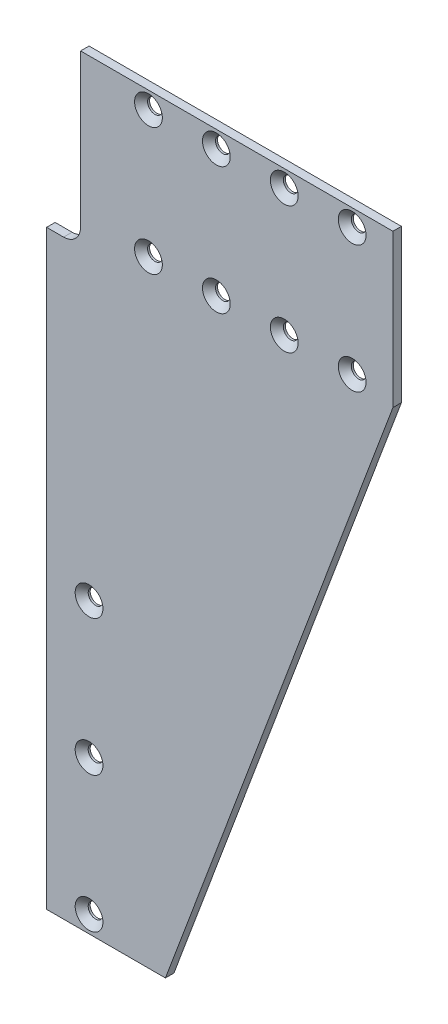
ISO-10303-21;
HEADER;
FILE_DESCRIPTION(('STEP AP214'),'2;1');
FILE_NAME('part.step','',(''),(''),'','','');
FILE_SCHEMA(('AUTOMOTIVE_DESIGN { 1 0 10303 214 1 1 1 1 }'));
ENDSEC;
DATA;
#1=APPLICATION_CONTEXT('core data for automotive mechanical design processes');
#2=APPLICATION_PROTOCOL_DEFINITION('international standard','automotive_design',2000,#1);
#3=PRODUCT_CONTEXT('',#1,'mechanical');
#4=PRODUCT('Part','Part','',(#3));
#5=PRODUCT_RELATED_PRODUCT_CATEGORY('part','',(#4));
#6=PRODUCT_DEFINITION_FORMATION('','',#4);
#7=PRODUCT_DEFINITION_CONTEXT('part definition',#1,'design');
#8=PRODUCT_DEFINITION('design','',#6,#7);
#9=PRODUCT_DEFINITION_SHAPE('','',#8);
#10=(LENGTH_UNIT() NAMED_UNIT(*) SI_UNIT(.MILLI.,.METRE.));
#11=(NAMED_UNIT(*) PLANE_ANGLE_UNIT() SI_UNIT($,.RADIAN.));
#12=(NAMED_UNIT(*) SI_UNIT($,.STERADIAN.) SOLID_ANGLE_UNIT());
#13=UNCERTAINTY_MEASURE_WITH_UNIT(LENGTH_MEASURE(1.E-05),#10,'distance_accuracy_value','');
#14=(GEOMETRIC_REPRESENTATION_CONTEXT(3) GLOBAL_UNCERTAINTY_ASSIGNED_CONTEXT((#13)) GLOBAL_UNIT_ASSIGNED_CONTEXT((#10,
#11,#12)) REPRESENTATION_CONTEXT('',''));
#15=CARTESIAN_POINT('',(0.,0.,0.));
#16=DIRECTION('',(0.,0.,1.));
#17=DIRECTION('',(1.,0.,0.));
#18=AXIS2_PLACEMENT_3D('',#15,#16,#17);
#19=CARTESIAN_POINT('',(6.35,227.33,0.));
#20=DIRECTION('',(0.,0.,-1.));
#21=DIRECTION('',(-1.,0.,0.));
#22=AXIS2_PLACEMENT_3D('',#19,#20,#21);
#23=PLANE('',#22);
#24=CARTESIAN_POINT('',(15.875,6.34999999999999,0.));
#25=DIRECTION('',(0.,0.,1.));
#26=DIRECTION('',(1.,0.,0.));
#27=AXIS2_PLACEMENT_3D('',#24,#25,#26);
#28=CIRCLE('',#27,5.1943);
#29=CARTESIAN_POINT('',(21.0693,6.34999999999999,0.));
#30=VERTEX_POINT('',#29);
#31=EDGE_CURVE('E279',#30,#30,#28,.T.);
#32=ORIENTED_EDGE('',*,*,#31,.F.);
#33=EDGE_LOOP('',(#32));
#34=FACE_BOUND('',#33,.T.);
#35=CARTESIAN_POINT('',(15.875,107.95,0.));
#36=DIRECTION('',(0.,0.,1.));
#37=DIRECTION('',(1.,0.,0.));
#38=AXIS2_PLACEMENT_3D('',#35,#36,#37);
#39=CIRCLE('',#38,5.1943);
#40=CARTESIAN_POINT('',(21.0693,107.95,0.));
#41=VERTEX_POINT('',#40);
#42=EDGE_CURVE('E295',#41,#41,#39,.T.);
#43=ORIENTED_EDGE('',*,*,#42,.F.);
#44=EDGE_LOOP('',(#43));
#45=FACE_BOUND('',#44,.T.);
#46=CARTESIAN_POINT('',(63.5,278.13,0.));
#47=DIRECTION('',(0.,0.,1.));
#48=DIRECTION('',(1.,0.,0.));
#49=AXIS2_PLACEMENT_3D('',#46,#47,#48);
#50=CIRCLE('',#49,5.1943);
#51=CARTESIAN_POINT('',(68.6943,278.13,0.));
#52=VERTEX_POINT('',#51);
#53=EDGE_CURVE('E340',#52,#52,#50,.T.);
#54=ORIENTED_EDGE('',*,*,#53,.F.);
#55=EDGE_LOOP('',(#54));
#56=FACE_BOUND('',#55,.T.);
#57=CARTESIAN_POINT('',(38.1,278.13,0.));
#58=DIRECTION('',(0.,0.,1.));
#59=DIRECTION('',(1.,0.,0.));
#60=AXIS2_PLACEMENT_3D('',#57,#58,#59);
#61=CIRCLE('',#60,5.1943);
#62=CARTESIAN_POINT('',(43.2943,278.13,0.));
#63=VERTEX_POINT('',#62);
#64=EDGE_CURVE('E358',#63,#63,#61,.T.);
#65=ORIENTED_EDGE('',*,*,#64,.F.);
#66=EDGE_LOOP('',(#65));
#67=FACE_BOUND('',#66,.T.);
#68=CARTESIAN_POINT('',(38.1,230.505,0.));
#69=DIRECTION('',(0.,0.,1.));
#70=DIRECTION('',(1.,0.,0.));
#71=AXIS2_PLACEMENT_3D('',#68,#69,#70);
#72=CIRCLE('',#71,5.1943);
#73=CARTESIAN_POINT('',(43.2943,230.505,0.));
#74=VERTEX_POINT('',#73);
#75=EDGE_CURVE('E367',#74,#74,#72,.T.);
#76=ORIENTED_EDGE('',*,*,#75,.F.);
#77=EDGE_LOOP('',(#76));
#78=FACE_BOUND('',#77,.T.);
#79=DIRECTION('',(1.,0.,0.));
#80=VECTOR('',#79,1.);
#81=CARTESIAN_POINT('',(44.45,0.,0.));
#82=LINE('',#81,#80);
#83=CARTESIAN_POINT('',(0.,0.,0.));
#84=VERTEX_POINT('',#83);
#85=CARTESIAN_POINT('',(44.45,0.,0.));
#86=VERTEX_POINT('',#85);
#87=EDGE_CURVE('E132',#84,#86,#82,.T.);
#88=ORIENTED_EDGE('',*,*,#87,.T.);
#89=DIRECTION('',(0.350549996082766,0.9365440193853,0.));
#90=VECTOR('',#89,1.);
#91=CARTESIAN_POINT('',(129.54,227.33,0.));
#92=LINE('',#91,#90);
#93=CARTESIAN_POINT('',(129.54,227.33,0.));
#94=VERTEX_POINT('',#93);
#95=EDGE_CURVE('E135',#86,#94,#92,.T.);
#96=ORIENTED_EDGE('',*,*,#95,.T.);
#97=DIRECTION('',(0.,1.,0.));
#98=VECTOR('',#97,1.);
#99=CARTESIAN_POINT('',(129.54,284.48,0.));
#100=LINE('',#99,#98);
#101=CARTESIAN_POINT('',(129.54,284.48,0.));
#102=VERTEX_POINT('',#101);
#103=EDGE_CURVE('E139',#94,#102,#100,.T.);
#104=ORIENTED_EDGE('',*,*,#103,.T.);
#105=DIRECTION('',(-1.,0.,0.));
#106=VECTOR('',#105,1.);
#107=CARTESIAN_POINT('',(12.7,284.48,0.));
#108=LINE('',#107,#106);
#109=CARTESIAN_POINT('',(12.7,284.48,0.));
#110=VERTEX_POINT('',#109);
#111=EDGE_CURVE('E142',#102,#110,#108,.T.);
#112=ORIENTED_EDGE('',*,*,#111,.T.);
#113=DIRECTION('',(0.,-1.,0.));
#114=VECTOR('',#113,1.);
#115=CARTESIAN_POINT('',(12.7,284.48,0.));
#116=LINE('',#115,#114);
#117=CARTESIAN_POINT('',(12.7,227.33,0.));
#118=VERTEX_POINT('',#117);
#119=EDGE_CURVE('E145',#110,#118,#116,.T.);
#120=ORIENTED_EDGE('',*,*,#119,.T.);
#121=CARTESIAN_POINT('',(6.35,227.33,0.));
#122=DIRECTION('',(0.,0.,-1.));
#123=DIRECTION('',(-1.,0.,0.));
#124=AXIS2_PLACEMENT_3D('',#121,#122,#123);
#125=CIRCLE('',#124,6.34999999999999);
#126=CARTESIAN_POINT('',(6.35,220.98,0.));
#127=VERTEX_POINT('',#126);
#128=EDGE_CURVE('E148',#118,#127,#125,.T.);
#129=ORIENTED_EDGE('',*,*,#128,.T.);
#130=DIRECTION('',(-1.,0.,0.));
#131=VECTOR('',#130,1.);
#132=CARTESIAN_POINT('',(6.35,220.98,0.));
#133=LINE('',#132,#131);
#134=CARTESIAN_POINT('',(0.,220.98,0.));
#135=VERTEX_POINT('',#134);
#136=EDGE_CURVE('E108',#127,#135,#133,.T.);
#137=ORIENTED_EDGE('',*,*,#136,.T.);
#138=DIRECTION('',(0.,-1.,0.));
#139=VECTOR('',#138,1.);
#140=CARTESIAN_POINT('',(0.,0.,0.));
#141=LINE('',#140,#139);
#142=EDGE_CURVE('E151',#135,#84,#141,.T.);
#143=ORIENTED_EDGE('',*,*,#142,.T.);
#144=EDGE_LOOP('',(#88,#96,#104,#112,#120,#129,#137,#143));
#145=FACE_BOUND('',#144,.T.);
#146=CARTESIAN_POINT('',(63.5,230.505,0.));
#147=DIRECTION('',(0.,0.,1.));
#148=DIRECTION('',(1.,0.,0.));
#149=AXIS2_PLACEMENT_3D('',#146,#147,#148);
#150=CIRCLE('',#149,5.1943);
#151=CARTESIAN_POINT('',(68.6943,230.505,0.));
#152=VERTEX_POINT('',#151);
#153=EDGE_CURVE('E349',#152,#152,#150,.T.);
#154=ORIENTED_EDGE('',*,*,#153,.F.);
#155=EDGE_LOOP('',(#154));
#156=FACE_BOUND('',#155,.T.);
#157=CARTESIAN_POINT('',(88.9,230.505,0.));
#158=DIRECTION('',(0.,0.,1.));
#159=DIRECTION('',(1.,0.,0.));
#160=AXIS2_PLACEMENT_3D('',#157,#158,#159);
#161=CIRCLE('',#160,5.1943);
#162=CARTESIAN_POINT('',(94.0943,230.505,0.));
#163=VERTEX_POINT('',#162);
#164=EDGE_CURVE('E331',#163,#163,#161,.T.);
#165=ORIENTED_EDGE('',*,*,#164,.F.);
#166=EDGE_LOOP('',(#165));
#167=FACE_BOUND('',#166,.T.);
#168=CARTESIAN_POINT('',(88.9,278.13,0.));
#169=DIRECTION('',(0.,0.,1.));
#170=DIRECTION('',(1.,0.,0.));
#171=AXIS2_PLACEMENT_3D('',#168,#169,#170);
#172=CIRCLE('',#171,5.1943);
#173=CARTESIAN_POINT('',(94.0943,278.13,0.));
#174=VERTEX_POINT('',#173);
#175=EDGE_CURVE('E322',#174,#174,#172,.T.);
#176=ORIENTED_EDGE('',*,*,#175,.F.);
#177=EDGE_LOOP('',(#176));
#178=FACE_BOUND('',#177,.T.);
#179=CARTESIAN_POINT('',(114.3,230.505,0.));
#180=DIRECTION('',(0.,0.,1.));
#181=DIRECTION('',(1.,0.,0.));
#182=AXIS2_PLACEMENT_3D('',#179,#180,#181);
#183=CIRCLE('',#182,5.1943);
#184=CARTESIAN_POINT('',(119.4943,230.505,0.));
#185=VERTEX_POINT('',#184);
#186=EDGE_CURVE('E313',#185,#185,#183,.T.);
#187=ORIENTED_EDGE('',*,*,#186,.F.);
#188=EDGE_LOOP('',(#187));
#189=FACE_BOUND('',#188,.T.);
#190=CARTESIAN_POINT('',(114.3,278.13,0.));
#191=DIRECTION('',(0.,0.,1.));
#192=DIRECTION('',(1.,0.,0.));
#193=AXIS2_PLACEMENT_3D('',#190,#191,#192);
#194=CIRCLE('',#193,5.1943);
#195=CARTESIAN_POINT('',(119.4943,278.13,0.));
#196=VERTEX_POINT('',#195);
#197=EDGE_CURVE('E304',#196,#196,#194,.T.);
#198=ORIENTED_EDGE('',*,*,#197,.F.);
#199=EDGE_LOOP('',(#198));
#200=FACE_BOUND('',#199,.T.);
#201=CARTESIAN_POINT('',(15.875,57.15,0.));
#202=DIRECTION('',(0.,0.,1.));
#203=DIRECTION('',(1.,0.,0.));
#204=AXIS2_PLACEMENT_3D('',#201,#202,#203);
#205=CIRCLE('',#204,5.1943);
#206=CARTESIAN_POINT('',(21.0693,57.15,0.));
#207=VERTEX_POINT('',#206);
#208=EDGE_CURVE('E286',#207,#207,#205,.T.);
#209=ORIENTED_EDGE('',*,*,#208,.F.);
#210=EDGE_LOOP('',(#209));
#211=FACE_BOUND('',#210,.T.);
#212=ADVANCED_FACE('F33',(#34,#45,#56,#67,#78,#145,#156,#167,#178,#189,#200,#211),#23,.F.);
#213=CARTESIAN_POINT('',(6.35,227.33,-3.175));
#214=DIRECTION('',(0.,0.,-1.));
#215=DIRECTION('',(-1.,0.,0.));
#216=AXIS2_PLACEMENT_3D('',#213,#214,#215);
#217=PLANE('',#216);
#218=CARTESIAN_POINT('',(15.875,6.34999999999999,-3.175));
#219=DIRECTION('',(0.,0.,1.));
#220=DIRECTION('',(1.,0.,0.));
#221=AXIS2_PLACEMENT_3D('',#218,#219,#220);
#222=CIRCLE('',#221,2.75589999999999);
#223=CARTESIAN_POINT('',(18.6309,6.34999999999999,-3.175));
#224=VERTEX_POINT('',#223);
#225=EDGE_CURVE('E281',#224,#224,#222,.T.);
#226=ORIENTED_EDGE('',*,*,#225,.T.);
#227=EDGE_LOOP('',(#226));
#228=FACE_BOUND('',#227,.T.);
#229=CARTESIAN_POINT('',(114.3,278.13,-3.175));
#230=DIRECTION('',(0.,0.,1.));
#231=DIRECTION('',(1.,0.,0.));
#232=AXIS2_PLACEMENT_3D('',#229,#230,#231);
#233=CIRCLE('',#232,2.75590000000001);
#234=CARTESIAN_POINT('',(117.0559,278.13,-3.175));
#235=VERTEX_POINT('',#234);
#236=EDGE_CURVE('E310',#235,#235,#233,.T.);
#237=ORIENTED_EDGE('',*,*,#236,.T.);
#238=EDGE_LOOP('',(#237));
#239=FACE_BOUND('',#238,.T.);
#240=CARTESIAN_POINT('',(114.3,230.505,-3.175));
#241=DIRECTION('',(0.,0.,1.));
#242=DIRECTION('',(1.,0.,0.));
#243=AXIS2_PLACEMENT_3D('',#240,#241,#242);
#244=CIRCLE('',#243,2.75590000000001);
#245=CARTESIAN_POINT('',(117.0559,230.505,-3.175));
#246=VERTEX_POINT('',#245);
#247=EDGE_CURVE('E319',#246,#246,#244,.T.);
#248=ORIENTED_EDGE('',*,*,#247,.T.);
#249=EDGE_LOOP('',(#248));
#250=FACE_BOUND('',#249,.T.);
#251=CARTESIAN_POINT('',(88.9,278.13,-3.175));
#252=DIRECTION('',(0.,0.,1.));
#253=DIRECTION('',(1.,0.,0.));
#254=AXIS2_PLACEMENT_3D('',#251,#252,#253);
#255=CIRCLE('',#254,2.75590000000001);
#256=CARTESIAN_POINT('',(91.6559,278.13,-3.175));
#257=VERTEX_POINT('',#256);
#258=EDGE_CURVE('E328',#257,#257,#255,.T.);
#259=ORIENTED_EDGE('',*,*,#258,.T.);
#260=EDGE_LOOP('',(#259));
#261=FACE_BOUND('',#260,.T.);
#262=CARTESIAN_POINT('',(88.9,230.505,-3.175));
#263=DIRECTION('',(0.,0.,1.));
#264=DIRECTION('',(1.,0.,0.));
#265=AXIS2_PLACEMENT_3D('',#262,#263,#264);
#266=CIRCLE('',#265,2.75590000000001);
#267=CARTESIAN_POINT('',(91.6559,230.505,-3.175));
#268=VERTEX_POINT('',#267);
#269=EDGE_CURVE('E337',#268,#268,#266,.T.);
#270=ORIENTED_EDGE('',*,*,#269,.T.);
#271=EDGE_LOOP('',(#270));
#272=FACE_BOUND('',#271,.T.);
#273=CARTESIAN_POINT('',(63.5,278.13,-3.175));
#274=DIRECTION('',(0.,0.,1.));
#275=DIRECTION('',(1.,0.,0.));
#276=AXIS2_PLACEMENT_3D('',#273,#274,#275);
#277=CIRCLE('',#276,2.75590000000001);
#278=CARTESIAN_POINT('',(66.2559,278.13,-3.175));
#279=VERTEX_POINT('',#278);
#280=EDGE_CURVE('E346',#279,#279,#277,.T.);
#281=ORIENTED_EDGE('',*,*,#280,.T.);
#282=EDGE_LOOP('',(#281));
#283=FACE_BOUND('',#282,.T.);
#284=CARTESIAN_POINT('',(63.5,230.505,-3.175));
#285=DIRECTION('',(0.,0.,1.));
#286=DIRECTION('',(1.,0.,0.));
#287=AXIS2_PLACEMENT_3D('',#284,#285,#286);
#288=CIRCLE('',#287,2.75590000000001);
#289=CARTESIAN_POINT('',(66.2559,230.505,-3.175));
#290=VERTEX_POINT('',#289);
#291=EDGE_CURVE('E355',#290,#290,#288,.T.);
#292=ORIENTED_EDGE('',*,*,#291,.T.);
#293=EDGE_LOOP('',(#292));
#294=FACE_BOUND('',#293,.T.);
#295=CARTESIAN_POINT('',(38.1,278.13,-3.175));
#296=DIRECTION('',(0.,0.,1.));
#297=DIRECTION('',(1.,0.,0.));
#298=AXIS2_PLACEMENT_3D('',#295,#296,#297);
#299=CIRCLE('',#298,2.7559);
#300=CARTESIAN_POINT('',(40.8559,278.13,-3.175));
#301=VERTEX_POINT('',#300);
#302=EDGE_CURVE('E364',#301,#301,#299,.T.);
#303=ORIENTED_EDGE('',*,*,#302,.T.);
#304=EDGE_LOOP('',(#303));
#305=FACE_BOUND('',#304,.T.);
#306=CARTESIAN_POINT('',(38.1,230.505,-3.175));
#307=DIRECTION('',(0.,0.,1.));
#308=DIRECTION('',(1.,0.,0.));
#309=AXIS2_PLACEMENT_3D('',#306,#307,#308);
#310=CIRCLE('',#309,2.7559);
#311=CARTESIAN_POINT('',(40.8559,230.505,-3.175));
#312=VERTEX_POINT('',#311);
#313=EDGE_CURVE('E136',#312,#312,#310,.T.);
#314=ORIENTED_EDGE('',*,*,#313,.T.);
#315=EDGE_LOOP('',(#314));
#316=FACE_BOUND('',#315,.T.);
#317=DIRECTION('',(1.,0.,0.));
#318=VECTOR('',#317,1.);
#319=CARTESIAN_POINT('',(44.45,0.,-3.175));
#320=LINE('',#319,#318);
#321=CARTESIAN_POINT('',(0.,0.,-3.175));
#322=VERTEX_POINT('',#321);
#323=CARTESIAN_POINT('',(44.45,0.,-3.175));
#324=VERTEX_POINT('',#323);
#325=EDGE_CURVE('E153',#322,#324,#320,.T.);
#326=ORIENTED_EDGE('',*,*,#325,.F.);
#327=DIRECTION('',(0.,-1.,0.));
#328=VECTOR('',#327,1.);
#329=CARTESIAN_POINT('',(0.,0.,-3.175));
#330=LINE('',#329,#328);
#331=CARTESIAN_POINT('',(0.,220.98,-3.175));
#332=VERTEX_POINT('',#331);
#333=EDGE_CURVE('E122',#332,#322,#330,.T.);
#334=ORIENTED_EDGE('',*,*,#333,.F.);
#335=DIRECTION('',(-1.,0.,0.));
#336=VECTOR('',#335,1.);
#337=CARTESIAN_POINT('',(6.35,220.98,-3.175));
#338=LINE('',#337,#336);
#339=CARTESIAN_POINT('',(6.35,220.98,-3.175));
#340=VERTEX_POINT('',#339);
#341=EDGE_CURVE('E106',#340,#332,#338,.T.);
#342=ORIENTED_EDGE('',*,*,#341,.F.);
#343=CARTESIAN_POINT('',(6.35,227.33,-3.175));
#344=DIRECTION('',(0.,0.,-1.));
#345=DIRECTION('',(-1.,0.,0.));
#346=AXIS2_PLACEMENT_3D('',#343,#344,#345);
#347=CIRCLE('',#346,6.34999999999999);
#348=CARTESIAN_POINT('',(12.7,227.33,-3.175));
#349=VERTEX_POINT('',#348);
#350=EDGE_CURVE('E120',#349,#340,#347,.T.);
#351=ORIENTED_EDGE('',*,*,#350,.F.);
#352=DIRECTION('',(0.,-1.,0.));
#353=VECTOR('',#352,1.);
#354=CARTESIAN_POINT('',(12.7,284.48,-3.175));
#355=LINE('',#354,#353);
#356=CARTESIAN_POINT('',(12.7,284.48,-3.175));
#357=VERTEX_POINT('',#356);
#358=EDGE_CURVE('E125',#357,#349,#355,.T.);
#359=ORIENTED_EDGE('',*,*,#358,.F.);
#360=DIRECTION('',(-1.,0.,0.));
#361=VECTOR('',#360,1.);
#362=CARTESIAN_POINT('',(12.7,284.48,-3.175));
#363=LINE('',#362,#361);
#364=CARTESIAN_POINT('',(129.54,284.48,-3.175));
#365=VERTEX_POINT('',#364);
#366=EDGE_CURVE('E127',#365,#357,#363,.T.);
#367=ORIENTED_EDGE('',*,*,#366,.F.);
#368=DIRECTION('',(0.,1.,0.));
#369=VECTOR('',#368,1.);
#370=CARTESIAN_POINT('',(129.54,284.48,-3.175));
#371=LINE('',#370,#369);
#372=CARTESIAN_POINT('',(129.54,227.33,-3.175));
#373=VERTEX_POINT('',#372);
#374=EDGE_CURVE('E378',#373,#365,#371,.T.);
#375=ORIENTED_EDGE('',*,*,#374,.F.);
#376=DIRECTION('',(0.350549996082766,0.9365440193853,0.));
#377=VECTOR('',#376,1.);
#378=CARTESIAN_POINT('',(129.54,227.33,-3.175));
#379=LINE('',#378,#377);
#380=EDGE_CURVE('E376',#324,#373,#379,.T.);
#381=ORIENTED_EDGE('',*,*,#380,.F.);
#382=EDGE_LOOP('',(#326,#334,#342,#351,#359,#367,#375,#381));
#383=FACE_BOUND('',#382,.T.);
#384=CARTESIAN_POINT('',(15.875,107.95,-3.175));
#385=DIRECTION('',(0.,0.,1.));
#386=DIRECTION('',(1.,0.,0.));
#387=AXIS2_PLACEMENT_3D('',#384,#385,#386);
#388=CIRCLE('',#387,2.75589999999999);
#389=CARTESIAN_POINT('',(18.6309,107.95,-3.175));
#390=VERTEX_POINT('',#389);
#391=EDGE_CURVE('E301',#390,#390,#388,.T.);
#392=ORIENTED_EDGE('',*,*,#391,.T.);
#393=EDGE_LOOP('',(#392));
#394=FACE_BOUND('',#393,.T.);
#395=CARTESIAN_POINT('',(15.875,57.15,-3.175));
#396=DIRECTION('',(0.,0.,1.));
#397=DIRECTION('',(1.,0.,0.));
#398=AXIS2_PLACEMENT_3D('',#395,#396,#397);
#399=CIRCLE('',#398,2.75589999999999);
#400=CARTESIAN_POINT('',(18.6309,57.15,-3.175));
#401=VERTEX_POINT('',#400);
#402=EDGE_CURVE('E292',#401,#401,#399,.T.);
#403=ORIENTED_EDGE('',*,*,#402,.T.);
#404=EDGE_LOOP('',(#403));
#405=FACE_BOUND('',#404,.T.);
#406=ADVANCED_FACE('F117',(#228,#239,#250,#261,#272,#283,#294,#305,#316,#383,#394,#405),#217,.T.);
#407=CARTESIAN_POINT('',(44.45,0.,-3.175));
#408=DIRECTION('',(0.,-1.,0.));
#409=DIRECTION('',(0.,0.,-1.));
#410=AXIS2_PLACEMENT_3D('',#407,#408,#409);
#411=PLANE('',#410);
#412=ORIENTED_EDGE('',*,*,#87,.F.);
#413=DIRECTION('',(0.,0.,1.));
#414=VECTOR('',#413,1.);
#415=CARTESIAN_POINT('',(0.,0.,-3.175));
#416=LINE('',#415,#414);
#417=EDGE_CURVE('E11',#322,#84,#416,.T.);
#418=ORIENTED_EDGE('',*,*,#417,.F.);
#419=ORIENTED_EDGE('',*,*,#325,.T.);
#420=DIRECTION('',(0.,0.,1.));
#421=VECTOR('',#420,1.);
#422=CARTESIAN_POINT('',(44.45,0.,-3.175));
#423=LINE('',#422,#421);
#424=EDGE_CURVE('E37',#324,#86,#423,.T.);
#425=ORIENTED_EDGE('',*,*,#424,.T.);
#426=EDGE_LOOP('',(#412,#418,#419,#425));
#427=FACE_BOUND('',#426,.T.);
#428=ADVANCED_FACE('F35',(#427),#411,.T.);
#429=CARTESIAN_POINT('',(0.,0.,-3.175));
#430=DIRECTION('',(-1.,0.,0.));
#431=DIRECTION('',(0.,0.,1.));
#432=AXIS2_PLACEMENT_3D('',#429,#430,#431);
#433=PLANE('',#432);
#434=ORIENTED_EDGE('',*,*,#142,.F.);
#435=DIRECTION('',(0.,0.,1.));
#436=VECTOR('',#435,1.);
#437=CARTESIAN_POINT('',(0.,220.98,-3.175));
#438=LINE('',#437,#436);
#439=EDGE_CURVE('E43',#332,#135,#438,.T.);
#440=ORIENTED_EDGE('',*,*,#439,.F.);
#441=ORIENTED_EDGE('',*,*,#333,.T.);
#442=ORIENTED_EDGE('',*,*,#417,.T.);
#443=EDGE_LOOP('',(#434,#440,#441,#442));
#444=FACE_BOUND('',#443,.T.);
#445=ADVANCED_FACE('F165',(#444),#433,.T.);
#446=CARTESIAN_POINT('',(6.35,220.98,-3.175));
#447=DIRECTION('',(0.,1.,0.));
#448=DIRECTION('',(0.,0.,1.));
#449=AXIS2_PLACEMENT_3D('',#446,#447,#448);
#450=PLANE('',#449);
#451=ORIENTED_EDGE('',*,*,#136,.F.);
#452=DIRECTION('',(0.,0.,1.));
#453=VECTOR('',#452,1.);
#454=CARTESIAN_POINT('',(6.35,220.98,-3.175));
#455=LINE('',#454,#453);
#456=EDGE_CURVE('E103',#340,#127,#455,.T.);
#457=ORIENTED_EDGE('',*,*,#456,.F.);
#458=ORIENTED_EDGE('',*,*,#341,.T.);
#459=ORIENTED_EDGE('',*,*,#439,.T.);
#460=EDGE_LOOP('',(#451,#457,#458,#459));
#461=FACE_BOUND('',#460,.T.);
#462=ADVANCED_FACE('F105',(#461),#450,.T.);
#463=CARTESIAN_POINT('',(6.35,227.33,-3.175));
#464=DIRECTION('',(0.,0.,1.));
#465=DIRECTION('',(1.,0.,0.));
#466=AXIS2_PLACEMENT_3D('',#463,#464,#465);
#467=CYLINDRICAL_SURFACE('',#466,6.34999999999999);
#468=ORIENTED_EDGE('',*,*,#128,.F.);
#469=DIRECTION('',(0.,0.,1.));
#470=VECTOR('',#469,1.);
#471=CARTESIAN_POINT('',(12.7,227.33,-3.175));
#472=LINE('',#471,#470);
#473=EDGE_CURVE('E113',#349,#118,#472,.T.);
#474=ORIENTED_EDGE('',*,*,#473,.F.);
#475=ORIENTED_EDGE('',*,*,#350,.T.);
#476=ORIENTED_EDGE('',*,*,#456,.T.);
#477=EDGE_LOOP('',(#468,#474,#475,#476));
#478=FACE_BOUND('',#477,.T.);
#479=ADVANCED_FACE('F124',(#478),#467,.F.);
#480=CARTESIAN_POINT('',(12.7,284.48,-3.175));
#481=DIRECTION('',(-1.,0.,0.));
#482=DIRECTION('',(0.,-1.,0.));
#483=AXIS2_PLACEMENT_3D('',#480,#481,#482);
#484=PLANE('',#483);
#485=ORIENTED_EDGE('',*,*,#119,.F.);
#486=DIRECTION('',(0.,0.,1.));
#487=VECTOR('',#486,1.);
#488=CARTESIAN_POINT('',(12.7,284.48,-3.175));
#489=LINE('',#488,#487);
#490=EDGE_CURVE('E157',#357,#110,#489,.T.);
#491=ORIENTED_EDGE('',*,*,#490,.F.);
#492=ORIENTED_EDGE('',*,*,#358,.T.);
#493=ORIENTED_EDGE('',*,*,#473,.T.);
#494=EDGE_LOOP('',(#485,#491,#492,#493));
#495=FACE_BOUND('',#494,.T.);
#496=ADVANCED_FACE('F390',(#495),#484,.T.);
#497=CARTESIAN_POINT('',(12.7,284.48,-3.175));
#498=DIRECTION('',(0.,1.,0.));
#499=DIRECTION('',(0.,0.,1.));
#500=AXIS2_PLACEMENT_3D('',#497,#498,#499);
#501=PLANE('',#500);
#502=ORIENTED_EDGE('',*,*,#111,.F.);
#503=DIRECTION('',(0.,0.,1.));
#504=VECTOR('',#503,1.);
#505=CARTESIAN_POINT('',(129.54,284.48,-3.175));
#506=LINE('',#505,#504);
#507=EDGE_CURVE('E159',#365,#102,#506,.T.);
#508=ORIENTED_EDGE('',*,*,#507,.F.);
#509=ORIENTED_EDGE('',*,*,#366,.T.);
#510=ORIENTED_EDGE('',*,*,#490,.T.);
#511=EDGE_LOOP('',(#502,#508,#509,#510));
#512=FACE_BOUND('',#511,.T.);
#513=ADVANCED_FACE('F384',(#512),#501,.T.);
#514=CARTESIAN_POINT('',(129.54,284.48,-3.175));
#515=DIRECTION('',(1.,0.,0.));
#516=DIRECTION('',(0.,0.,-1.));
#517=AXIS2_PLACEMENT_3D('',#514,#515,#516);
#518=PLANE('',#517);
#519=ORIENTED_EDGE('',*,*,#103,.F.);
#520=DIRECTION('',(0.,0.,1.));
#521=VECTOR('',#520,1.);
#522=CARTESIAN_POINT('',(129.54,227.33,-3.175));
#523=LINE('',#522,#521);
#524=EDGE_CURVE('E160',#373,#94,#523,.T.);
#525=ORIENTED_EDGE('',*,*,#524,.F.);
#526=ORIENTED_EDGE('',*,*,#374,.T.);
#527=ORIENTED_EDGE('',*,*,#507,.T.);
#528=EDGE_LOOP('',(#519,#525,#526,#527));
#529=FACE_BOUND('',#528,.T.);
#530=ADVANCED_FACE('F388',(#529),#518,.T.);
#531=CARTESIAN_POINT('',(129.54,227.33,-3.175));
#532=DIRECTION('',(0.9365440193853,-0.350549996082766,0.));
#533=DIRECTION('',(0.350549996082766,0.9365440193853,0.));
#534=AXIS2_PLACEMENT_3D('',#531,#532,#533);
#535=PLANE('',#534);
#536=ORIENTED_EDGE('',*,*,#95,.F.);
#537=ORIENTED_EDGE('',*,*,#424,.F.);
#538=ORIENTED_EDGE('',*,*,#380,.T.);
#539=ORIENTED_EDGE('',*,*,#524,.T.);
#540=EDGE_LOOP('',(#536,#537,#538,#539));
#541=FACE_BOUND('',#540,.T.);
#542=ADVANCED_FACE('F162',(#541),#535,.T.);
#543=CARTESIAN_POINT('',(38.1,230.505,0.));
#544=DIRECTION('',(0.,0.,1.));
#545=DIRECTION('',(1.,0.,0.));
#546=AXIS2_PLACEMENT_3D('',#543,#544,#545);
#547=CYLINDRICAL_SURFACE('',#546,2.7559);
#548=ORIENTED_EDGE('',*,*,#313,.F.);
#549=EDGE_LOOP('',(#548));
#550=FACE_BOUND('',#549,.T.);
#551=CARTESIAN_POINT('',(38.1,230.505,-2.4384));
#552=DIRECTION('',(0.,0.,1.));
#553=DIRECTION('',(1.,0.,0.));
#554=AXIS2_PLACEMENT_3D('',#551,#552,#553);
#555=CIRCLE('',#554,2.7559);
#556=CARTESIAN_POINT('',(40.8559,230.505,-2.4384));
#557=VERTEX_POINT('',#556);
#558=EDGE_CURVE('E370',#557,#557,#555,.T.);
#559=ORIENTED_EDGE('',*,*,#558,.T.);
#560=EDGE_LOOP('',(#559));
#561=FACE_BOUND('',#560,.T.);
#562=ADVANCED_FACE('F185',(#550,#561),#547,.F.);
#563=CARTESIAN_POINT('',(38.1,230.505,0.));
#564=DIRECTION('',(0.,0.,1.));
#565=DIRECTION('',(1.,0.,0.));
#566=AXIS2_PLACEMENT_3D('',#563,#564,#565);
#567=CONICAL_SURFACE('',#566,5.1943,0.785398163397449);
#568=ORIENTED_EDGE('',*,*,#558,.F.);
#569=EDGE_LOOP('',(#568));
#570=FACE_BOUND('',#569,.T.);
#571=ORIENTED_EDGE('',*,*,#75,.T.);
#572=EDGE_LOOP('',(#571));
#573=FACE_BOUND('',#572,.T.);
#574=ADVANCED_FACE('F188',(#570,#573),#567,.F.);
#575=CARTESIAN_POINT('',(38.1,278.13,0.));
#576=DIRECTION('',(0.,0.,1.));
#577=DIRECTION('',(1.,0.,0.));
#578=AXIS2_PLACEMENT_3D('',#575,#576,#577);
#579=CYLINDRICAL_SURFACE('',#578,2.7559);
#580=ORIENTED_EDGE('',*,*,#302,.F.);
#581=EDGE_LOOP('',(#580));
#582=FACE_BOUND('',#581,.T.);
#583=CARTESIAN_POINT('',(38.1,278.13,-2.4384));
#584=DIRECTION('',(0.,0.,1.));
#585=DIRECTION('',(1.,0.,0.));
#586=AXIS2_PLACEMENT_3D('',#583,#584,#585);
#587=CIRCLE('',#586,2.7559);
#588=CARTESIAN_POINT('',(40.8559,278.13,-2.4384));
#589=VERTEX_POINT('',#588);
#590=EDGE_CURVE('E361',#589,#589,#587,.T.);
#591=ORIENTED_EDGE('',*,*,#590,.T.);
#592=EDGE_LOOP('',(#591));
#593=FACE_BOUND('',#592,.T.);
#594=ADVANCED_FACE('F192',(#582,#593),#579,.F.);
#595=CARTESIAN_POINT('',(38.1,278.13,0.));
#596=DIRECTION('',(0.,0.,1.));
#597=DIRECTION('',(1.,0.,0.));
#598=AXIS2_PLACEMENT_3D('',#595,#596,#597);
#599=CONICAL_SURFACE('',#598,5.1943,0.785398163397449);
#600=ORIENTED_EDGE('',*,*,#590,.F.);
#601=EDGE_LOOP('',(#600));
#602=FACE_BOUND('',#601,.T.);
#603=ORIENTED_EDGE('',*,*,#64,.T.);
#604=EDGE_LOOP('',(#603));
#605=FACE_BOUND('',#604,.T.);
#606=ADVANCED_FACE('F196',(#602,#605),#599,.F.);
#607=CARTESIAN_POINT('',(63.5,230.505,0.));
#608=DIRECTION('',(0.,0.,1.));
#609=DIRECTION('',(1.,0.,0.));
#610=AXIS2_PLACEMENT_3D('',#607,#608,#609);
#611=CYLINDRICAL_SURFACE('',#610,2.75590000000001);
#612=ORIENTED_EDGE('',*,*,#291,.F.);
#613=EDGE_LOOP('',(#612));
#614=FACE_BOUND('',#613,.T.);
#615=CARTESIAN_POINT('',(63.5,230.505,-2.4384));
#616=DIRECTION('',(0.,0.,1.));
#617=DIRECTION('',(1.,0.,0.));
#618=AXIS2_PLACEMENT_3D('',#615,#616,#617);
#619=CIRCLE('',#618,2.75590000000001);
#620=CARTESIAN_POINT('',(66.2559,230.505,-2.4384));
#621=VERTEX_POINT('',#620);
#622=EDGE_CURVE('E352',#621,#621,#619,.T.);
#623=ORIENTED_EDGE('',*,*,#622,.T.);
#624=EDGE_LOOP('',(#623));
#625=FACE_BOUND('',#624,.T.);
#626=ADVANCED_FACE('F200',(#614,#625),#611,.F.);
#627=CARTESIAN_POINT('',(63.5,230.505,0.));
#628=DIRECTION('',(0.,0.,1.));
#629=DIRECTION('',(1.,0.,0.));
#630=AXIS2_PLACEMENT_3D('',#627,#628,#629);
#631=CONICAL_SURFACE('',#630,5.1943,0.785398163397447);
#632=ORIENTED_EDGE('',*,*,#622,.F.);
#633=EDGE_LOOP('',(#632));
#634=FACE_BOUND('',#633,.T.);
#635=ORIENTED_EDGE('',*,*,#153,.T.);
#636=EDGE_LOOP('',(#635));
#637=FACE_BOUND('',#636,.T.);
#638=ADVANCED_FACE('F204',(#634,#637),#631,.F.);
#639=CARTESIAN_POINT('',(63.5,278.13,0.));
#640=DIRECTION('',(0.,0.,1.));
#641=DIRECTION('',(1.,0.,0.));
#642=AXIS2_PLACEMENT_3D('',#639,#640,#641);
#643=CYLINDRICAL_SURFACE('',#642,2.75590000000001);
#644=ORIENTED_EDGE('',*,*,#280,.F.);
#645=EDGE_LOOP('',(#644));
#646=FACE_BOUND('',#645,.T.);
#647=CARTESIAN_POINT('',(63.5,278.13,-2.4384));
#648=DIRECTION('',(0.,0.,1.));
#649=DIRECTION('',(1.,0.,0.));
#650=AXIS2_PLACEMENT_3D('',#647,#648,#649);
#651=CIRCLE('',#650,2.75590000000001);
#652=CARTESIAN_POINT('',(66.2559,278.13,-2.4384));
#653=VERTEX_POINT('',#652);
#654=EDGE_CURVE('E343',#653,#653,#651,.T.);
#655=ORIENTED_EDGE('',*,*,#654,.T.);
#656=EDGE_LOOP('',(#655));
#657=FACE_BOUND('',#656,.T.);
#658=ADVANCED_FACE('F208',(#646,#657),#643,.F.);
#659=CARTESIAN_POINT('',(63.5,278.13,0.));
#660=DIRECTION('',(0.,0.,1.));
#661=DIRECTION('',(1.,0.,0.));
#662=AXIS2_PLACEMENT_3D('',#659,#660,#661);
#663=CONICAL_SURFACE('',#662,5.1943,0.785398163397447);
#664=ORIENTED_EDGE('',*,*,#654,.F.);
#665=EDGE_LOOP('',(#664));
#666=FACE_BOUND('',#665,.T.);
#667=ORIENTED_EDGE('',*,*,#53,.T.);
#668=EDGE_LOOP('',(#667));
#669=FACE_BOUND('',#668,.T.);
#670=ADVANCED_FACE('F212',(#666,#669),#663,.F.);
#671=CARTESIAN_POINT('',(88.9,230.505,0.));
#672=DIRECTION('',(0.,0.,1.));
#673=DIRECTION('',(1.,0.,0.));
#674=AXIS2_PLACEMENT_3D('',#671,#672,#673);
#675=CYLINDRICAL_SURFACE('',#674,2.75590000000001);
#676=ORIENTED_EDGE('',*,*,#269,.F.);
#677=EDGE_LOOP('',(#676));
#678=FACE_BOUND('',#677,.T.);
#679=CARTESIAN_POINT('',(88.9,230.505,-2.4384));
#680=DIRECTION('',(0.,0.,1.));
#681=DIRECTION('',(1.,0.,0.));
#682=AXIS2_PLACEMENT_3D('',#679,#680,#681);
#683=CIRCLE('',#682,2.75590000000001);
#684=CARTESIAN_POINT('',(91.6559,230.505,-2.4384));
#685=VERTEX_POINT('',#684);
#686=EDGE_CURVE('E334',#685,#685,#683,.T.);
#687=ORIENTED_EDGE('',*,*,#686,.T.);
#688=EDGE_LOOP('',(#687));
#689=FACE_BOUND('',#688,.T.);
#690=ADVANCED_FACE('F216',(#678,#689),#675,.F.);
#691=CARTESIAN_POINT('',(88.9,230.505,0.));
#692=DIRECTION('',(0.,0.,1.));
#693=DIRECTION('',(1.,0.,0.));
#694=AXIS2_PLACEMENT_3D('',#691,#692,#693);
#695=CONICAL_SURFACE('',#694,5.1943,0.785398163397447);
#696=ORIENTED_EDGE('',*,*,#686,.F.);
#697=EDGE_LOOP('',(#696));
#698=FACE_BOUND('',#697,.T.);
#699=ORIENTED_EDGE('',*,*,#164,.T.);
#700=EDGE_LOOP('',(#699));
#701=FACE_BOUND('',#700,.T.);
#702=ADVANCED_FACE('F220',(#698,#701),#695,.F.);
#703=CARTESIAN_POINT('',(88.9,278.13,0.));
#704=DIRECTION('',(0.,0.,1.));
#705=DIRECTION('',(1.,0.,0.));
#706=AXIS2_PLACEMENT_3D('',#703,#704,#705);
#707=CYLINDRICAL_SURFACE('',#706,2.75590000000001);
#708=ORIENTED_EDGE('',*,*,#258,.F.);
#709=EDGE_LOOP('',(#708));
#710=FACE_BOUND('',#709,.T.);
#711=CARTESIAN_POINT('',(88.9,278.13,-2.4384));
#712=DIRECTION('',(0.,0.,1.));
#713=DIRECTION('',(1.,0.,0.));
#714=AXIS2_PLACEMENT_3D('',#711,#712,#713);
#715=CIRCLE('',#714,2.75590000000001);
#716=CARTESIAN_POINT('',(91.6559,278.13,-2.4384));
#717=VERTEX_POINT('',#716);
#718=EDGE_CURVE('E325',#717,#717,#715,.T.);
#719=ORIENTED_EDGE('',*,*,#718,.T.);
#720=EDGE_LOOP('',(#719));
#721=FACE_BOUND('',#720,.T.);
#722=ADVANCED_FACE('F224',(#710,#721),#707,.F.);
#723=CARTESIAN_POINT('',(88.9,278.13,0.));
#724=DIRECTION('',(0.,0.,1.));
#725=DIRECTION('',(1.,0.,0.));
#726=AXIS2_PLACEMENT_3D('',#723,#724,#725);
#727=CONICAL_SURFACE('',#726,5.1943,0.785398163397447);
#728=ORIENTED_EDGE('',*,*,#718,.F.);
#729=EDGE_LOOP('',(#728));
#730=FACE_BOUND('',#729,.T.);
#731=ORIENTED_EDGE('',*,*,#175,.T.);
#732=EDGE_LOOP('',(#731));
#733=FACE_BOUND('',#732,.T.);
#734=ADVANCED_FACE('F228',(#730,#733),#727,.F.);
#735=CARTESIAN_POINT('',(114.3,230.505,0.));
#736=DIRECTION('',(0.,0.,1.));
#737=DIRECTION('',(1.,0.,0.));
#738=AXIS2_PLACEMENT_3D('',#735,#736,#737);
#739=CYLINDRICAL_SURFACE('',#738,2.75590000000001);
#740=ORIENTED_EDGE('',*,*,#247,.F.);
#741=EDGE_LOOP('',(#740));
#742=FACE_BOUND('',#741,.T.);
#743=CARTESIAN_POINT('',(114.3,230.505,-2.4384));
#744=DIRECTION('',(0.,0.,1.));
#745=DIRECTION('',(1.,0.,0.));
#746=AXIS2_PLACEMENT_3D('',#743,#744,#745);
#747=CIRCLE('',#746,2.75590000000001);
#748=CARTESIAN_POINT('',(117.0559,230.505,-2.4384));
#749=VERTEX_POINT('',#748);
#750=EDGE_CURVE('E316',#749,#749,#747,.T.);
#751=ORIENTED_EDGE('',*,*,#750,.T.);
#752=EDGE_LOOP('',(#751));
#753=FACE_BOUND('',#752,.T.);
#754=ADVANCED_FACE('F232',(#742,#753),#739,.F.);
#755=CARTESIAN_POINT('',(114.3,230.505,0.));
#756=DIRECTION('',(0.,0.,1.));
#757=DIRECTION('',(1.,0.,0.));
#758=AXIS2_PLACEMENT_3D('',#755,#756,#757);
#759=CONICAL_SURFACE('',#758,5.1943,0.785398163397447);
#760=ORIENTED_EDGE('',*,*,#750,.F.);
#761=EDGE_LOOP('',(#760));
#762=FACE_BOUND('',#761,.T.);
#763=ORIENTED_EDGE('',*,*,#186,.T.);
#764=EDGE_LOOP('',(#763));
#765=FACE_BOUND('',#764,.T.);
#766=ADVANCED_FACE('F236',(#762,#765),#759,.F.);
#767=CARTESIAN_POINT('',(114.3,278.13,0.));
#768=DIRECTION('',(0.,0.,1.));
#769=DIRECTION('',(1.,0.,0.));
#770=AXIS2_PLACEMENT_3D('',#767,#768,#769);
#771=CYLINDRICAL_SURFACE('',#770,2.75590000000001);
#772=ORIENTED_EDGE('',*,*,#236,.F.);
#773=EDGE_LOOP('',(#772));
#774=FACE_BOUND('',#773,.T.);
#775=CARTESIAN_POINT('',(114.3,278.13,-2.4384));
#776=DIRECTION('',(0.,0.,1.));
#777=DIRECTION('',(1.,0.,0.));
#778=AXIS2_PLACEMENT_3D('',#775,#776,#777);
#779=CIRCLE('',#778,2.75590000000001);
#780=CARTESIAN_POINT('',(117.0559,278.13,-2.4384));
#781=VERTEX_POINT('',#780);
#782=EDGE_CURVE('E307',#781,#781,#779,.T.);
#783=ORIENTED_EDGE('',*,*,#782,.T.);
#784=EDGE_LOOP('',(#783));
#785=FACE_BOUND('',#784,.T.);
#786=ADVANCED_FACE('F240',(#774,#785),#771,.F.);
#787=CARTESIAN_POINT('',(114.3,278.13,0.));
#788=DIRECTION('',(0.,0.,1.));
#789=DIRECTION('',(1.,0.,0.));
#790=AXIS2_PLACEMENT_3D('',#787,#788,#789);
#791=CONICAL_SURFACE('',#790,5.1943,0.785398163397447);
#792=ORIENTED_EDGE('',*,*,#782,.F.);
#793=EDGE_LOOP('',(#792));
#794=FACE_BOUND('',#793,.T.);
#795=ORIENTED_EDGE('',*,*,#197,.T.);
#796=EDGE_LOOP('',(#795));
#797=FACE_BOUND('',#796,.T.);
#798=ADVANCED_FACE('F244',(#794,#797),#791,.F.);
#799=CARTESIAN_POINT('',(15.875,107.95,0.));
#800=DIRECTION('',(0.,0.,1.));
#801=DIRECTION('',(1.,0.,0.));
#802=AXIS2_PLACEMENT_3D('',#799,#800,#801);
#803=CYLINDRICAL_SURFACE('',#802,2.75589999999999);
#804=ORIENTED_EDGE('',*,*,#391,.F.);
#805=EDGE_LOOP('',(#804));
#806=FACE_BOUND('',#805,.T.);
#807=CARTESIAN_POINT('',(15.875,107.95,-2.43840000000001));
#808=DIRECTION('',(0.,0.,1.));
#809=DIRECTION('',(1.,0.,0.));
#810=AXIS2_PLACEMENT_3D('',#807,#808,#809);
#811=CIRCLE('',#810,2.75589999999999);
#812=CARTESIAN_POINT('',(18.6309,107.95,-2.43840000000001));
#813=VERTEX_POINT('',#812);
#814=EDGE_CURVE('E298',#813,#813,#811,.T.);
#815=ORIENTED_EDGE('',*,*,#814,.T.);
#816=EDGE_LOOP('',(#815));
#817=FACE_BOUND('',#816,.T.);
#818=ADVANCED_FACE('F248',(#806,#817),#803,.F.);
#819=CARTESIAN_POINT('',(15.875,107.95,0.));
#820=DIRECTION('',(0.,0.,1.));
#821=DIRECTION('',(1.,0.,0.));
#822=AXIS2_PLACEMENT_3D('',#819,#820,#821);
#823=CONICAL_SURFACE('',#822,5.1943,0.785398163397449);
#824=ORIENTED_EDGE('',*,*,#814,.F.);
#825=EDGE_LOOP('',(#824));
#826=FACE_BOUND('',#825,.T.);
#827=ORIENTED_EDGE('',*,*,#42,.T.);
#828=EDGE_LOOP('',(#827));
#829=FACE_BOUND('',#828,.T.);
#830=ADVANCED_FACE('F252',(#826,#829),#823,.F.);
#831=CARTESIAN_POINT('',(15.875,57.15,0.));
#832=DIRECTION('',(0.,0.,1.));
#833=DIRECTION('',(1.,0.,0.));
#834=AXIS2_PLACEMENT_3D('',#831,#832,#833);
#835=CYLINDRICAL_SURFACE('',#834,2.75589999999999);
#836=ORIENTED_EDGE('',*,*,#402,.F.);
#837=EDGE_LOOP('',(#836));
#838=FACE_BOUND('',#837,.T.);
#839=CARTESIAN_POINT('',(15.875,57.15,-2.43840000000001));
#840=DIRECTION('',(0.,0.,1.));
#841=DIRECTION('',(1.,0.,0.));
#842=AXIS2_PLACEMENT_3D('',#839,#840,#841);
#843=CIRCLE('',#842,2.75589999999999);
#844=CARTESIAN_POINT('',(18.6309,57.15,-2.43840000000001));
#845=VERTEX_POINT('',#844);
#846=EDGE_CURVE('E289',#845,#845,#843,.T.);
#847=ORIENTED_EDGE('',*,*,#846,.T.);
#848=EDGE_LOOP('',(#847));
#849=FACE_BOUND('',#848,.T.);
#850=ADVANCED_FACE('F256',(#838,#849),#835,.F.);
#851=CARTESIAN_POINT('',(15.875,57.15,0.));
#852=DIRECTION('',(0.,0.,1.));
#853=DIRECTION('',(1.,0.,0.));
#854=AXIS2_PLACEMENT_3D('',#851,#852,#853);
#855=CONICAL_SURFACE('',#854,5.1943,0.785398163397449);
#856=ORIENTED_EDGE('',*,*,#846,.F.);
#857=EDGE_LOOP('',(#856));
#858=FACE_BOUND('',#857,.T.);
#859=ORIENTED_EDGE('',*,*,#208,.T.);
#860=EDGE_LOOP('',(#859));
#861=FACE_BOUND('',#860,.T.);
#862=ADVANCED_FACE('F260',(#858,#861),#855,.F.);
#863=CARTESIAN_POINT('',(15.875,6.34999999999999,0.));
#864=DIRECTION('',(0.,0.,1.));
#865=DIRECTION('',(1.,0.,0.));
#866=AXIS2_PLACEMENT_3D('',#863,#864,#865);
#867=CYLINDRICAL_SURFACE('',#866,2.75589999999999);
#868=ORIENTED_EDGE('',*,*,#225,.F.);
#869=EDGE_LOOP('',(#868));
#870=FACE_BOUND('',#869,.T.);
#871=CARTESIAN_POINT('',(15.875,6.34999999999999,-2.43840000000001));
#872=DIRECTION('',(0.,0.,1.));
#873=DIRECTION('',(1.,0.,0.));
#874=AXIS2_PLACEMENT_3D('',#871,#872,#873);
#875=CIRCLE('',#874,2.75589999999999);
#876=CARTESIAN_POINT('',(18.6309,6.34999999999999,-2.43840000000001));
#877=VERTEX_POINT('',#876);
#878=EDGE_CURVE('E277',#877,#877,#875,.T.);
#879=ORIENTED_EDGE('',*,*,#878,.T.);
#880=EDGE_LOOP('',(#879));
#881=FACE_BOUND('',#880,.T.);
#882=ADVANCED_FACE('F264',(#870,#881),#867,.F.);
#883=CARTESIAN_POINT('',(15.875,6.34999999999999,0.));
#884=DIRECTION('',(0.,0.,1.));
#885=DIRECTION('',(1.,0.,0.));
#886=AXIS2_PLACEMENT_3D('',#883,#884,#885);
#887=CONICAL_SURFACE('',#886,5.1943,0.785398163397449);
#888=ORIENTED_EDGE('',*,*,#878,.F.);
#889=EDGE_LOOP('',(#888));
#890=FACE_BOUND('',#889,.T.);
#891=ORIENTED_EDGE('',*,*,#31,.T.);
#892=EDGE_LOOP('',(#891));
#893=FACE_BOUND('',#892,.T.);
#894=ADVANCED_FACE('F268',(#890,#893),#887,.F.);
#895=CLOSED_SHELL('',(#212,#406,#428,#445,#462,#479,#496,#513,#530,#542,#562,#574,#594,#606,
#626,#638,#658,#670,#690,#702,#722,#734,#754,#766,#786,#798,#818,#830,#850,#862,#882,#894));
#896=MANIFOLD_SOLID_BREP('B2',#895);
#897=ADVANCED_BREP_SHAPE_REPRESENTATION('',(#18,#896),#14);
#898=SHAPE_DEFINITION_REPRESENTATION(#9,#897);
ENDSEC;
END-ISO-10303-21;
